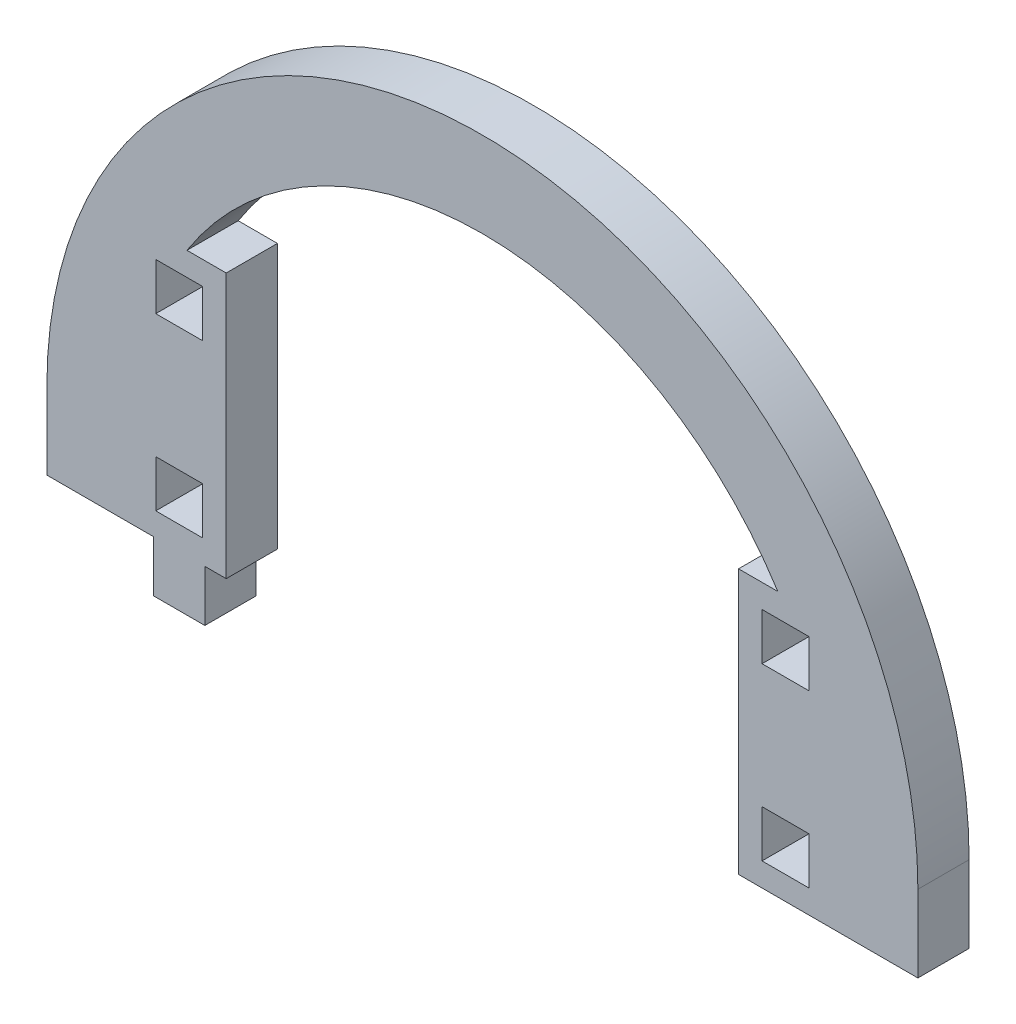
ISO-10303-21;
HEADER;
FILE_DESCRIPTION(('STEP AP214'),'2;1');
FILE_NAME('part.step','',(''),(''),'','','');
FILE_SCHEMA(('AUTOMOTIVE_DESIGN { 1 0 10303 214 1 1 1 1 }'));
ENDSEC;
DATA;
#1=APPLICATION_CONTEXT('core data for automotive mechanical design processes');
#2=APPLICATION_PROTOCOL_DEFINITION('international standard','automotive_design',2000,#1);
#3=PRODUCT_CONTEXT('',#1,'mechanical');
#4=PRODUCT('Part','Part','',(#3));
#5=PRODUCT_RELATED_PRODUCT_CATEGORY('part','',(#4));
#6=PRODUCT_DEFINITION_FORMATION('','',#4);
#7=PRODUCT_DEFINITION_CONTEXT('part definition',#1,'design');
#8=PRODUCT_DEFINITION('design','',#6,#7);
#9=PRODUCT_DEFINITION_SHAPE('','',#8);
#10=(LENGTH_UNIT() NAMED_UNIT(*) SI_UNIT(.MILLI.,.METRE.));
#11=(NAMED_UNIT(*) PLANE_ANGLE_UNIT() SI_UNIT($,.RADIAN.));
#12=(NAMED_UNIT(*) SI_UNIT($,.STERADIAN.) SOLID_ANGLE_UNIT());
#13=UNCERTAINTY_MEASURE_WITH_UNIT(LENGTH_MEASURE(1.E-05),#10,'distance_accuracy_value','');
#14=(GEOMETRIC_REPRESENTATION_CONTEXT(3) GLOBAL_UNCERTAINTY_ASSIGNED_CONTEXT((#13)) GLOBAL_UNIT_ASSIGNED_CONTEXT((#10,
#11,#12)) REPRESENTATION_CONTEXT('',''));
#15=CARTESIAN_POINT('',(0.,0.,0.));
#16=DIRECTION('',(0.,0.,1.));
#17=DIRECTION('',(1.,0.,0.));
#18=AXIS2_PLACEMENT_3D('',#15,#16,#17);
#19=CARTESIAN_POINT('',(3106.22516019874,1478.74469762239,6.));
#20=DIRECTION('',(0.,0.,1.));
#21=DIRECTION('',(1.,0.,0.));
#22=AXIS2_PLACEMENT_3D('',#19,#20,#21);
#23=PLANE('',#22);
#24=CARTESIAN_POINT('',(3106.22516019874,1478.74469762239,6.));
#25=DIRECTION('',(0.,0.,1.));
#26=DIRECTION('',(1.,0.,0.));
#27=AXIS2_PLACEMENT_3D('',#24,#25,#26);
#28=CIRCLE('',#27,50.9999999999999);
#29=CARTESIAN_POINT('',(3157.22516019874,1478.74469762239,6.));
#30=VERTEX_POINT('',#29);
#31=CARTESIAN_POINT('',(3055.22516019874,1478.74469762239,6.));
#32=VERTEX_POINT('',#31);
#33=EDGE_CURVE('E642',#30,#32,#28,.T.);
#34=ORIENTED_EDGE('',*,*,#33,.T.);
#35=DIRECTION('',(0.,-1.,0.));
#36=VECTOR('',#35,1.);
#37=CARTESIAN_POINT('',(3055.22516019874,1478.74469762239,6.));
#38=LINE('',#37,#36);
#39=CARTESIAN_POINT('',(3055.22516019874,1469.74469762239,6.));
#40=VERTEX_POINT('',#39);
#41=EDGE_CURVE('E646',#32,#40,#38,.T.);
#42=ORIENTED_EDGE('',*,*,#41,.T.);
#43=DIRECTION('',(1.,0.,0.));
#44=VECTOR('',#43,1.);
#45=CARTESIAN_POINT('',(3055.22516019874,1469.74469762239,6.));
#46=LINE('',#45,#44);
#47=CARTESIAN_POINT('',(3067.72516019874,1469.74469762239,6.));
#48=VERTEX_POINT('',#47);
#49=EDGE_CURVE('E650',#40,#48,#46,.T.);
#50=ORIENTED_EDGE('',*,*,#49,.T.);
#51=DIRECTION('',(0.,-1.,0.));
#52=VECTOR('',#51,1.);
#53=CARTESIAN_POINT('',(3067.72516019874,1469.74469762239,6.));
#54=LINE('',#53,#52);
#55=CARTESIAN_POINT('',(3067.72516019874,1463.74469762239,6.));
#56=VERTEX_POINT('',#55);
#57=EDGE_CURVE('E653',#48,#56,#54,.T.);
#58=ORIENTED_EDGE('',*,*,#57,.T.);
#59=DIRECTION('',(1.,0.,0.));
#60=VECTOR('',#59,1.);
#61=CARTESIAN_POINT('',(3067.72516019874,1463.74469762239,6.));
#62=LINE('',#61,#60);
#63=CARTESIAN_POINT('',(3073.72516019874,1463.74469762239,6.));
#64=VERTEX_POINT('',#63);
#65=EDGE_CURVE('E656',#56,#64,#62,.T.);
#66=ORIENTED_EDGE('',*,*,#65,.T.);
#67=DIRECTION('',(0.,1.,0.));
#68=VECTOR('',#67,1.);
#69=CARTESIAN_POINT('',(3073.72516019874,1463.74469762239,6.));
#70=LINE('',#69,#68);
#71=CARTESIAN_POINT('',(3073.72516019874,1469.74469762239,6.));
#72=VERTEX_POINT('',#71);
#73=EDGE_CURVE('E659',#64,#72,#70,.T.);
#74=ORIENTED_EDGE('',*,*,#73,.T.);
#75=DIRECTION('',(1.,0.,0.));
#76=VECTOR('',#75,1.);
#77=CARTESIAN_POINT('',(3073.72516019874,1469.74469762239,6.));
#78=LINE('',#77,#76);
#79=CARTESIAN_POINT('',(3076.22516019874,1469.74469762239,6.));
#80=VERTEX_POINT('',#79);
#81=EDGE_CURVE('E662',#72,#80,#78,.T.);
#82=ORIENTED_EDGE('',*,*,#81,.T.);
#83=DIRECTION('',(0.,-1.,0.));
#84=VECTOR('',#83,1.);
#85=CARTESIAN_POINT('',(3076.22516019874,1500.74469762239,6.));
#86=LINE('',#85,#84);
#87=CARTESIAN_POINT('',(3076.22516019874,1500.74469762239,6.));
#88=VERTEX_POINT('',#87);
#89=EDGE_CURVE('E665',#88,#80,#86,.T.);
#90=ORIENTED_EDGE('',*,*,#89,.F.);
#91=DIRECTION('',(-1.,0.,0.));
#92=VECTOR('',#91,1.);
#93=CARTESIAN_POINT('',(3076.22516019874,1500.74469762239,6.));
#94=LINE('',#93,#92);
#95=CARTESIAN_POINT('',(3071.62747241473,1500.74469762239,6.));
#96=VERTEX_POINT('',#95);
#97=EDGE_CURVE('E669',#88,#96,#94,.T.);
#98=ORIENTED_EDGE('',*,*,#97,.T.);
#99=CARTESIAN_POINT('',(3106.22516019874,1478.74469762239,6.));
#100=DIRECTION('',(0.,0.,1.));
#101=DIRECTION('',(1.,0.,0.));
#102=AXIS2_PLACEMENT_3D('',#99,#100,#101);
#103=CIRCLE('',#102,40.9999999999998);
#104=CARTESIAN_POINT('',(3140.82284798276,1500.74469762239,6.));
#105=VERTEX_POINT('',#104);
#106=EDGE_CURVE('E672',#105,#96,#103,.T.);
#107=ORIENTED_EDGE('',*,*,#106,.F.);
#108=DIRECTION('',(-1.,0.,0.));
#109=VECTOR('',#108,1.);
#110=CARTESIAN_POINT('',(3140.82284798276,1500.74469762239,6.));
#111=LINE('',#110,#109);
#112=CARTESIAN_POINT('',(3136.22516019874,1500.74469762239,6.));
#113=VERTEX_POINT('',#112);
#114=EDGE_CURVE('E676',#105,#113,#111,.T.);
#115=ORIENTED_EDGE('',*,*,#114,.T.);
#116=DIRECTION('',(0.,-1.,0.));
#117=VECTOR('',#116,1.);
#118=CARTESIAN_POINT('',(3136.22516019874,1500.74469762239,6.));
#119=LINE('',#118,#117);
#120=CARTESIAN_POINT('',(3136.22516019874,1469.74469762239,6.));
#121=VERTEX_POINT('',#120);
#122=EDGE_CURVE('E679',#113,#121,#119,.T.);
#123=ORIENTED_EDGE('',*,*,#122,.T.);
#124=DIRECTION('',(1.,0.,0.));
#125=VECTOR('',#124,1.);
#126=CARTESIAN_POINT('',(3136.22516019874,1469.74469762239,6.));
#127=LINE('',#126,#125);
#128=CARTESIAN_POINT('',(3157.22516019874,1469.74469762239,6.));
#129=VERTEX_POINT('',#128);
#130=EDGE_CURVE('E682',#121,#129,#127,.T.);
#131=ORIENTED_EDGE('',*,*,#130,.T.);
#132=DIRECTION('',(0.,-1.,0.));
#133=VECTOR('',#132,1.);
#134=CARTESIAN_POINT('',(3157.22516019874,1478.74469762239,6.));
#135=LINE('',#134,#133);
#136=EDGE_CURVE('E685',#30,#129,#135,.T.);
#137=ORIENTED_EDGE('',*,*,#136,.F.);
#138=EDGE_LOOP('',(#34,#42,#50,#58,#66,#74,#82,#90,#98,#107,#115,#123,#131,#137));
#139=FACE_BOUND('',#138,.T.);
#140=DIRECTION('',(0.,1.,0.));
#141=VECTOR('',#140,1.);
#142=CARTESIAN_POINT('',(3073.47516019874,0.,6.));
#143=LINE('',#142,#141);
#144=CARTESIAN_POINT('',(3073.47516019874,1472.49469762239,6.));
#145=VERTEX_POINT('',#144);
#146=CARTESIAN_POINT('',(3073.47516019874,1477.99469762239,6.));
#147=VERTEX_POINT('',#146);
#148=EDGE_CURVE('E602',#145,#147,#143,.T.);
#149=ORIENTED_EDGE('',*,*,#148,.F.);
#150=DIRECTION('',(1.,0.,0.));
#151=VECTOR('',#150,1.);
#152=CARTESIAN_POINT('',(0.,1472.49469762239,6.));
#153=LINE('',#152,#151);
#154=CARTESIAN_POINT('',(3067.97516019874,1472.49469762239,6.));
#155=VERTEX_POINT('',#154);
#156=EDGE_CURVE('E599',#155,#145,#153,.T.);
#157=ORIENTED_EDGE('',*,*,#156,.F.);
#158=DIRECTION('',(0.,-1.,0.));
#159=VECTOR('',#158,1.);
#160=CARTESIAN_POINT('',(3067.97516019874,0.,6.));
#161=LINE('',#160,#159);
#162=CARTESIAN_POINT('',(3067.97516019874,1477.99469762239,6.));
#163=VERTEX_POINT('',#162);
#164=EDGE_CURVE('E610',#163,#155,#161,.T.);
#165=ORIENTED_EDGE('',*,*,#164,.F.);
#166=DIRECTION('',(-1.,0.,0.));
#167=VECTOR('',#166,1.);
#168=CARTESIAN_POINT('',(0.,1477.99469762239,6.));
#169=LINE('',#168,#167);
#170=EDGE_CURVE('E606',#147,#163,#169,.T.);
#171=ORIENTED_EDGE('',*,*,#170,.F.);
#172=EDGE_LOOP('',(#149,#157,#165,#171));
#173=FACE_BOUND('',#172,.T.);
#174=DIRECTION('',(0.,1.,0.));
#175=VECTOR('',#174,1.);
#176=CARTESIAN_POINT('',(3073.47516019874,0.,6.));
#177=LINE('',#176,#175);
#178=CARTESIAN_POINT('',(3073.47516019874,1492.49469762239,6.));
#179=VERTEX_POINT('',#178);
#180=CARTESIAN_POINT('',(3073.47516019874,1497.99469762239,6.));
#181=VERTEX_POINT('',#180);
#182=EDGE_CURVE('E559',#179,#181,#177,.T.);
#183=ORIENTED_EDGE('',*,*,#182,.F.);
#184=DIRECTION('',(1.,0.,0.));
#185=VECTOR('',#184,1.);
#186=CARTESIAN_POINT('',(0.,1492.49469762239,6.));
#187=LINE('',#186,#185);
#188=CARTESIAN_POINT('',(3067.97516019874,1492.49469762239,6.));
#189=VERTEX_POINT('',#188);
#190=EDGE_CURVE('E556',#189,#179,#187,.T.);
#191=ORIENTED_EDGE('',*,*,#190,.F.);
#192=DIRECTION('',(0.,-1.,0.));
#193=VECTOR('',#192,1.);
#194=CARTESIAN_POINT('',(3067.97516019874,0.,6.));
#195=LINE('',#194,#193);
#196=CARTESIAN_POINT('',(3067.97516019874,1497.99469762239,6.));
#197=VERTEX_POINT('',#196);
#198=EDGE_CURVE('E567',#197,#189,#195,.T.);
#199=ORIENTED_EDGE('',*,*,#198,.F.);
#200=DIRECTION('',(-1.,0.,0.));
#201=VECTOR('',#200,1.);
#202=CARTESIAN_POINT('',(0.,1497.99469762239,6.));
#203=LINE('',#202,#201);
#204=EDGE_CURVE('E563',#181,#197,#203,.T.);
#205=ORIENTED_EDGE('',*,*,#204,.F.);
#206=EDGE_LOOP('',(#183,#191,#199,#205));
#207=FACE_BOUND('',#206,.T.);
#208=DIRECTION('',(0.,1.,0.));
#209=VECTOR('',#208,1.);
#210=CARTESIAN_POINT('',(3144.47516019875,0.,6.));
#211=LINE('',#210,#209);
#212=CARTESIAN_POINT('',(3144.47516019875,1492.49469762239,6.));
#213=VERTEX_POINT('',#212);
#214=CARTESIAN_POINT('',(3144.47516019875,1497.99469762239,6.));
#215=VERTEX_POINT('',#214);
#216=EDGE_CURVE('E516',#213,#215,#211,.T.);
#217=ORIENTED_EDGE('',*,*,#216,.F.);
#218=DIRECTION('',(1.,0.,0.));
#219=VECTOR('',#218,1.);
#220=CARTESIAN_POINT('',(0.,1492.49469762239,6.));
#221=LINE('',#220,#219);
#222=CARTESIAN_POINT('',(3138.97516019874,1492.49469762239,6.));
#223=VERTEX_POINT('',#222);
#224=EDGE_CURVE('E513',#223,#213,#221,.T.);
#225=ORIENTED_EDGE('',*,*,#224,.F.);
#226=DIRECTION('',(0.,-1.,0.));
#227=VECTOR('',#226,1.);
#228=CARTESIAN_POINT('',(3138.97516019874,0.,6.));
#229=LINE('',#228,#227);
#230=CARTESIAN_POINT('',(3138.97516019874,1497.99469762239,6.));
#231=VERTEX_POINT('',#230);
#232=EDGE_CURVE('E524',#231,#223,#229,.T.);
#233=ORIENTED_EDGE('',*,*,#232,.F.);
#234=DIRECTION('',(-1.,0.,0.));
#235=VECTOR('',#234,1.);
#236=CARTESIAN_POINT('',(0.,1497.99469762239,6.));
#237=LINE('',#236,#235);
#238=EDGE_CURVE('E520',#215,#231,#237,.T.);
#239=ORIENTED_EDGE('',*,*,#238,.F.);
#240=EDGE_LOOP('',(#217,#225,#233,#239));
#241=FACE_BOUND('',#240,.T.);
#242=DIRECTION('',(0.,1.,0.));
#243=VECTOR('',#242,1.);
#244=CARTESIAN_POINT('',(3144.47516019875,0.,6.));
#245=LINE('',#244,#243);
#246=CARTESIAN_POINT('',(3144.47516019875,1472.49469762239,6.));
#247=VERTEX_POINT('',#246);
#248=CARTESIAN_POINT('',(3144.47516019875,1477.99469762239,6.));
#249=VERTEX_POINT('',#248);
#250=EDGE_CURVE('E474',#247,#249,#245,.T.);
#251=ORIENTED_EDGE('',*,*,#250,.F.);
#252=DIRECTION('',(1.,0.,0.));
#253=VECTOR('',#252,1.);
#254=CARTESIAN_POINT('',(0.,1472.49469762239,6.));
#255=LINE('',#254,#253);
#256=CARTESIAN_POINT('',(3138.97516019874,1472.49469762239,6.));
#257=VERTEX_POINT('',#256);
#258=EDGE_CURVE('E465',#257,#247,#255,.T.);
#259=ORIENTED_EDGE('',*,*,#258,.F.);
#260=DIRECTION('',(0.,-1.,0.));
#261=VECTOR('',#260,1.);
#262=CARTESIAN_POINT('',(3138.97516019874,0.,6.));
#263=LINE('',#262,#261);
#264=CARTESIAN_POINT('',(3138.97516019874,1477.99469762239,6.));
#265=VERTEX_POINT('',#264);
#266=EDGE_CURVE('E491',#265,#257,#263,.T.);
#267=ORIENTED_EDGE('',*,*,#266,.F.);
#268=DIRECTION('',(-1.,0.,0.));
#269=VECTOR('',#268,1.);
#270=CARTESIAN_POINT('',(0.,1477.99469762239,6.));
#271=LINE('',#270,#269);
#272=EDGE_CURVE('E487',#249,#265,#271,.T.);
#273=ORIENTED_EDGE('',*,*,#272,.F.);
#274=EDGE_LOOP('',(#251,#259,#267,#273));
#275=FACE_BOUND('',#274,.T.);
#276=ADVANCED_FACE('F267',(#139,#173,#207,#241,#275),#23,.T.);
#277=CARTESIAN_POINT('',(3106.22516019874,1478.74469762239,0.));
#278=DIRECTION('',(0.,0.,1.));
#279=DIRECTION('',(1.,0.,0.));
#280=AXIS2_PLACEMENT_3D('',#277,#278,#279);
#281=PLANE('',#280);
#282=DIRECTION('',(1.,0.,0.));
#283=VECTOR('',#282,1.);
#284=CARTESIAN_POINT('',(0.,1492.49469762239,0.));
#285=LINE('',#284,#283);
#286=CARTESIAN_POINT('',(3138.97516019874,1492.49469762239,0.));
#287=VERTEX_POINT('',#286);
#288=CARTESIAN_POINT('',(3144.47516019875,1492.49469762239,0.));
#289=VERTEX_POINT('',#288);
#290=EDGE_CURVE('E483',#287,#289,#285,.T.);
#291=ORIENTED_EDGE('',*,*,#290,.T.);
#292=DIRECTION('',(0.,1.,0.));
#293=VECTOR('',#292,1.);
#294=CARTESIAN_POINT('',(3144.47516019875,0.,0.));
#295=LINE('',#294,#293);
#296=CARTESIAN_POINT('',(3144.47516019875,1497.99469762239,0.));
#297=VERTEX_POINT('',#296);
#298=EDGE_CURVE('E531',#289,#297,#295,.T.);
#299=ORIENTED_EDGE('',*,*,#298,.T.);
#300=DIRECTION('',(-1.,0.,0.));
#301=VECTOR('',#300,1.);
#302=CARTESIAN_POINT('',(0.,1497.99469762239,0.));
#303=LINE('',#302,#301);
#304=CARTESIAN_POINT('',(3138.97516019874,1497.99469762239,0.));
#305=VERTEX_POINT('',#304);
#306=EDGE_CURVE('E535',#297,#305,#303,.T.);
#307=ORIENTED_EDGE('',*,*,#306,.T.);
#308=DIRECTION('',(0.,-1.,0.));
#309=VECTOR('',#308,1.);
#310=CARTESIAN_POINT('',(3138.97516019874,0.,0.));
#311=LINE('',#310,#309);
#312=EDGE_CURVE('E517',#305,#287,#311,.T.);
#313=ORIENTED_EDGE('',*,*,#312,.T.);
#314=EDGE_LOOP('',(#291,#299,#307,#313));
#315=FACE_BOUND('',#314,.T.);
#316=DIRECTION('',(1.,0.,0.));
#317=VECTOR('',#316,1.);
#318=CARTESIAN_POINT('',(0.,1472.49469762239,0.));
#319=LINE('',#318,#317);
#320=CARTESIAN_POINT('',(3067.97516019874,1472.49469762239,0.));
#321=VERTEX_POINT('',#320);
#322=CARTESIAN_POINT('',(3073.47516019874,1472.49469762239,0.));
#323=VERTEX_POINT('',#322);
#324=EDGE_CURVE('E598',#321,#323,#319,.T.);
#325=ORIENTED_EDGE('',*,*,#324,.T.);
#326=DIRECTION('',(0.,1.,0.));
#327=VECTOR('',#326,1.);
#328=CARTESIAN_POINT('',(3073.47516019874,0.,0.));
#329=LINE('',#328,#327);
#330=CARTESIAN_POINT('',(3073.47516019874,1477.99469762239,0.));
#331=VERTEX_POINT('',#330);
#332=EDGE_CURVE('E617',#323,#331,#329,.T.);
#333=ORIENTED_EDGE('',*,*,#332,.T.);
#334=DIRECTION('',(-1.,0.,0.));
#335=VECTOR('',#334,1.);
#336=CARTESIAN_POINT('',(0.,1477.99469762239,0.));
#337=LINE('',#336,#335);
#338=CARTESIAN_POINT('',(3067.97516019874,1477.99469762239,0.));
#339=VERTEX_POINT('',#338);
#340=EDGE_CURVE('E621',#331,#339,#337,.T.);
#341=ORIENTED_EDGE('',*,*,#340,.T.);
#342=DIRECTION('',(0.,-1.,0.));
#343=VECTOR('',#342,1.);
#344=CARTESIAN_POINT('',(3067.97516019874,0.,0.));
#345=LINE('',#344,#343);
#346=EDGE_CURVE('E603',#339,#321,#345,.T.);
#347=ORIENTED_EDGE('',*,*,#346,.T.);
#348=EDGE_LOOP('',(#325,#333,#341,#347));
#349=FACE_BOUND('',#348,.T.);
#350=CARTESIAN_POINT('',(3106.22516019874,1478.74469762239,0.));
#351=DIRECTION('',(0.,0.,1.));
#352=DIRECTION('',(1.,0.,0.));
#353=AXIS2_PLACEMENT_3D('',#350,#351,#352);
#354=CIRCLE('',#353,50.9999999999999);
#355=CARTESIAN_POINT('',(3157.22516019874,1478.74469762239,0.));
#356=VERTEX_POINT('',#355);
#357=CARTESIAN_POINT('',(3055.22516019874,1478.74469762239,0.));
#358=VERTEX_POINT('',#357);
#359=EDGE_CURVE('E641',#356,#358,#354,.T.);
#360=ORIENTED_EDGE('',*,*,#359,.F.);
#361=DIRECTION('',(0.,-1.,0.));
#362=VECTOR('',#361,1.);
#363=CARTESIAN_POINT('',(3157.22516019874,1478.74469762239,0.));
#364=LINE('',#363,#362);
#365=CARTESIAN_POINT('',(3157.22516019874,1469.74469762239,0.));
#366=VERTEX_POINT('',#365);
#367=EDGE_CURVE('E647',#356,#366,#364,.T.);
#368=ORIENTED_EDGE('',*,*,#367,.T.);
#369=DIRECTION('',(-1.,0.,0.));
#370=VECTOR('',#369,1.);
#371=CARTESIAN_POINT('',(3157.22516019874,1469.74469762239,0.));
#372=LINE('',#371,#370);
#373=CARTESIAN_POINT('',(3136.22516019874,1469.74469762239,0.));
#374=VERTEX_POINT('',#373);
#375=EDGE_CURVE('E731',#366,#374,#372,.T.);
#376=ORIENTED_EDGE('',*,*,#375,.T.);
#377=DIRECTION('',(0.,-1.,0.));
#378=VECTOR('',#377,1.);
#379=CARTESIAN_POINT('',(3136.22516019874,1500.74469762239,0.));
#380=LINE('',#379,#378);
#381=CARTESIAN_POINT('',(3136.22516019874,1500.74469762239,0.));
#382=VERTEX_POINT('',#381);
#383=EDGE_CURVE('E727',#382,#374,#380,.T.);
#384=ORIENTED_EDGE('',*,*,#383,.F.);
#385=DIRECTION('',(-1.,0.,0.));
#386=VECTOR('',#385,1.);
#387=CARTESIAN_POINT('',(3140.82284798276,1500.74469762239,0.));
#388=LINE('',#387,#386);
#389=CARTESIAN_POINT('',(3140.82284798276,1500.74469762239,0.));
#390=VERTEX_POINT('',#389);
#391=EDGE_CURVE('E724',#390,#382,#388,.T.);
#392=ORIENTED_EDGE('',*,*,#391,.F.);
#393=CARTESIAN_POINT('',(3106.22516019874,1478.74469762239,0.));
#394=DIRECTION('',(0.,0.,1.));
#395=DIRECTION('',(1.,0.,0.));
#396=AXIS2_PLACEMENT_3D('',#393,#394,#395);
#397=CIRCLE('',#396,40.9999999999998);
#398=CARTESIAN_POINT('',(3071.62747241473,1500.74469762239,0.));
#399=VERTEX_POINT('',#398);
#400=EDGE_CURVE('E720',#390,#399,#397,.T.);
#401=ORIENTED_EDGE('',*,*,#400,.T.);
#402=DIRECTION('',(-1.,0.,0.));
#403=VECTOR('',#402,1.);
#404=CARTESIAN_POINT('',(3076.22516019874,1500.74469762239,0.));
#405=LINE('',#404,#403);
#406=CARTESIAN_POINT('',(3076.22516019874,1500.74469762239,0.));
#407=VERTEX_POINT('',#406);
#408=EDGE_CURVE('E716',#407,#399,#405,.T.);
#409=ORIENTED_EDGE('',*,*,#408,.F.);
#410=DIRECTION('',(0.,-1.,0.));
#411=VECTOR('',#410,1.);
#412=CARTESIAN_POINT('',(3076.22516019874,1500.74469762239,0.));
#413=LINE('',#412,#411);
#414=CARTESIAN_POINT('',(3076.22516019874,1469.74469762239,0.));
#415=VERTEX_POINT('',#414);
#416=EDGE_CURVE('E712',#407,#415,#413,.T.);
#417=ORIENTED_EDGE('',*,*,#416,.T.);
#418=DIRECTION('',(1.,0.,0.));
#419=VECTOR('',#418,1.);
#420=CARTESIAN_POINT('',(3073.72516019874,1469.74469762239,0.));
#421=LINE('',#420,#419);
#422=CARTESIAN_POINT('',(3073.72516019874,1469.74469762239,0.));
#423=VERTEX_POINT('',#422);
#424=EDGE_CURVE('E708',#423,#415,#421,.T.);
#425=ORIENTED_EDGE('',*,*,#424,.F.);
#426=DIRECTION('',(0.,1.,0.));
#427=VECTOR('',#426,1.);
#428=CARTESIAN_POINT('',(3073.72516019874,1463.74469762239,0.));
#429=LINE('',#428,#427);
#430=CARTESIAN_POINT('',(3073.72516019874,1463.74469762239,0.));
#431=VERTEX_POINT('',#430);
#432=EDGE_CURVE('E705',#431,#423,#429,.T.);
#433=ORIENTED_EDGE('',*,*,#432,.F.);
#434=DIRECTION('',(1.,0.,0.));
#435=VECTOR('',#434,1.);
#436=CARTESIAN_POINT('',(3067.72516019874,1463.74469762239,0.));
#437=LINE('',#436,#435);
#438=CARTESIAN_POINT('',(3067.72516019874,1463.74469762239,0.));
#439=VERTEX_POINT('',#438);
#440=EDGE_CURVE('E702',#439,#431,#437,.T.);
#441=ORIENTED_EDGE('',*,*,#440,.F.);
#442=DIRECTION('',(0.,-1.,0.));
#443=VECTOR('',#442,1.);
#444=CARTESIAN_POINT('',(3067.72516019874,1469.74469762239,0.));
#445=LINE('',#444,#443);
#446=CARTESIAN_POINT('',(3067.72516019874,1469.74469762239,0.));
#447=VERTEX_POINT('',#446);
#448=EDGE_CURVE('E699',#447,#439,#445,.T.);
#449=ORIENTED_EDGE('',*,*,#448,.F.);
#450=DIRECTION('',(1.,0.,0.));
#451=VECTOR('',#450,1.);
#452=CARTESIAN_POINT('',(3055.22516019874,1469.74469762239,0.));
#453=LINE('',#452,#451);
#454=CARTESIAN_POINT('',(3055.22516019874,1469.74469762239,0.));
#455=VERTEX_POINT('',#454);
#456=EDGE_CURVE('E696',#455,#447,#453,.T.);
#457=ORIENTED_EDGE('',*,*,#456,.F.);
#458=DIRECTION('',(0.,-1.,0.));
#459=VECTOR('',#458,1.);
#460=CARTESIAN_POINT('',(3055.22516019874,1478.74469762239,0.));
#461=LINE('',#460,#459);
#462=EDGE_CURVE('E693',#358,#455,#461,.T.);
#463=ORIENTED_EDGE('',*,*,#462,.F.);
#464=EDGE_LOOP('',(#360,#368,#376,#384,#392,#401,#409,#417,#425,#433,#441,#449,#457,#463));
#465=FACE_BOUND('',#464,.T.);
#466=DIRECTION('',(1.,0.,0.));
#467=VECTOR('',#466,1.);
#468=CARTESIAN_POINT('',(0.,1492.49469762239,0.));
#469=LINE('',#468,#467);
#470=CARTESIAN_POINT('',(3067.97516019874,1492.49469762239,0.));
#471=VERTEX_POINT('',#470);
#472=CARTESIAN_POINT('',(3073.47516019874,1492.49469762239,0.));
#473=VERTEX_POINT('',#472);
#474=EDGE_CURVE('E555',#471,#473,#469,.T.);
#475=ORIENTED_EDGE('',*,*,#474,.T.);
#476=DIRECTION('',(0.,1.,0.));
#477=VECTOR('',#476,1.);
#478=CARTESIAN_POINT('',(3073.47516019874,0.,0.));
#479=LINE('',#478,#477);
#480=CARTESIAN_POINT('',(3073.47516019874,1497.99469762239,0.));
#481=VERTEX_POINT('',#480);
#482=EDGE_CURVE('E574',#473,#481,#479,.T.);
#483=ORIENTED_EDGE('',*,*,#482,.T.);
#484=DIRECTION('',(-1.,0.,0.));
#485=VECTOR('',#484,1.);
#486=CARTESIAN_POINT('',(0.,1497.99469762239,0.));
#487=LINE('',#486,#485);
#488=CARTESIAN_POINT('',(3067.97516019874,1497.99469762239,0.));
#489=VERTEX_POINT('',#488);
#490=EDGE_CURVE('E578',#481,#489,#487,.T.);
#491=ORIENTED_EDGE('',*,*,#490,.T.);
#492=DIRECTION('',(0.,-1.,0.));
#493=VECTOR('',#492,1.);
#494=CARTESIAN_POINT('',(3067.97516019874,0.,0.));
#495=LINE('',#494,#493);
#496=EDGE_CURVE('E560',#489,#471,#495,.T.);
#497=ORIENTED_EDGE('',*,*,#496,.T.);
#498=EDGE_LOOP('',(#475,#483,#491,#497));
#499=FACE_BOUND('',#498,.T.);
#500=DIRECTION('',(1.,0.,0.));
#501=VECTOR('',#500,1.);
#502=CARTESIAN_POINT('',(0.,1472.49469762239,0.));
#503=LINE('',#502,#501);
#504=CARTESIAN_POINT('',(3138.97516019874,1472.49469762239,0.));
#505=VERTEX_POINT('',#504);
#506=CARTESIAN_POINT('',(3144.47516019875,1472.49469762239,0.));
#507=VERTEX_POINT('',#506);
#508=EDGE_CURVE('E291',#505,#507,#503,.T.);
#509=ORIENTED_EDGE('',*,*,#508,.T.);
#510=DIRECTION('',(0.,1.,0.));
#511=VECTOR('',#510,1.);
#512=CARTESIAN_POINT('',(3144.47516019875,0.,0.));
#513=LINE('',#512,#511);
#514=CARTESIAN_POINT('',(3144.47516019875,1477.99469762239,0.));
#515=VERTEX_POINT('',#514);
#516=EDGE_CURVE('E481',#507,#515,#513,.T.);
#517=ORIENTED_EDGE('',*,*,#516,.T.);
#518=DIRECTION('',(-1.,0.,0.));
#519=VECTOR('',#518,1.);
#520=CARTESIAN_POINT('',(0.,1477.99469762239,0.));
#521=LINE('',#520,#519);
#522=CARTESIAN_POINT('',(3138.97516019874,1477.99469762239,0.));
#523=VERTEX_POINT('',#522);
#524=EDGE_CURVE('E500',#515,#523,#521,.T.);
#525=ORIENTED_EDGE('',*,*,#524,.T.);
#526=DIRECTION('',(0.,-1.,0.));
#527=VECTOR('',#526,1.);
#528=CARTESIAN_POINT('',(3138.97516019874,0.,0.));
#529=LINE('',#528,#527);
#530=EDGE_CURVE('E475',#523,#505,#529,.T.);
#531=ORIENTED_EDGE('',*,*,#530,.T.);
#532=EDGE_LOOP('',(#509,#517,#525,#531));
#533=FACE_BOUND('',#532,.T.);
#534=ADVANCED_FACE('F789',(#315,#349,#465,#499,#533),#281,.F.);
#535=CARTESIAN_POINT('',(3106.22516019874,1478.74469762239,6.));
#536=DIRECTION('',(0.,0.,-1.));
#537=DIRECTION('',(-1.,0.,0.));
#538=AXIS2_PLACEMENT_3D('',#535,#536,#537);
#539=CYLINDRICAL_SURFACE('',#538,50.9999999999999);
#540=ORIENTED_EDGE('',*,*,#359,.T.);
#541=DIRECTION('',(0.,0.,-1.));
#542=VECTOR('',#541,1.);
#543=CARTESIAN_POINT('',(3055.22516019874,1478.74469762239,6.));
#544=LINE('',#543,#542);
#545=EDGE_CURVE('E12',#32,#358,#544,.T.);
#546=ORIENTED_EDGE('',*,*,#545,.F.);
#547=ORIENTED_EDGE('',*,*,#33,.F.);
#548=DIRECTION('',(0.,0.,-1.));
#549=VECTOR('',#548,1.);
#550=CARTESIAN_POINT('',(3157.22516019874,1478.74469762239,6.));
#551=LINE('',#550,#549);
#552=EDGE_CURVE('E689',#30,#356,#551,.T.);
#553=ORIENTED_EDGE('',*,*,#552,.T.);
#554=EDGE_LOOP('',(#540,#546,#547,#553));
#555=FACE_BOUND('',#554,.T.);
#556=ADVANCED_FACE('F269',(#555),#539,.T.);
#557=CARTESIAN_POINT('',(3055.22516019874,1478.74469762239,6.));
#558=DIRECTION('',(1.,0.,0.));
#559=DIRECTION('',(0.,0.,-1.));
#560=AXIS2_PLACEMENT_3D('',#557,#558,#559);
#561=PLANE('',#560);
#562=ORIENTED_EDGE('',*,*,#462,.T.);
#563=DIRECTION('',(0.,0.,-1.));
#564=VECTOR('',#563,1.);
#565=CARTESIAN_POINT('',(3055.22516019874,1469.74469762239,6.));
#566=LINE('',#565,#564);
#567=EDGE_CURVE('E276',#40,#455,#566,.T.);
#568=ORIENTED_EDGE('',*,*,#567,.F.);
#569=ORIENTED_EDGE('',*,*,#41,.F.);
#570=ORIENTED_EDGE('',*,*,#545,.T.);
#571=EDGE_LOOP('',(#562,#568,#569,#570));
#572=FACE_BOUND('',#571,.T.);
#573=ADVANCED_FACE('F808',(#572),#561,.F.);
#574=CARTESIAN_POINT('',(3055.22516019874,1469.74469762239,6.));
#575=DIRECTION('',(0.,1.,0.));
#576=DIRECTION('',(0.,0.,1.));
#577=AXIS2_PLACEMENT_3D('',#574,#575,#576);
#578=PLANE('',#577);
#579=ORIENTED_EDGE('',*,*,#456,.T.);
#580=DIRECTION('',(0.,0.,-1.));
#581=VECTOR('',#580,1.);
#582=CARTESIAN_POINT('',(3067.72516019874,1469.74469762239,6.));
#583=LINE('',#582,#581);
#584=EDGE_CURVE('E774',#48,#447,#583,.T.);
#585=ORIENTED_EDGE('',*,*,#584,.F.);
#586=ORIENTED_EDGE('',*,*,#49,.F.);
#587=ORIENTED_EDGE('',*,*,#567,.T.);
#588=EDGE_LOOP('',(#579,#585,#586,#587));
#589=FACE_BOUND('',#588,.T.);
#590=ADVANCED_FACE('F783',(#589),#578,.F.);
#591=CARTESIAN_POINT('',(3067.72516019874,1469.74469762239,6.));
#592=DIRECTION('',(1.,0.,0.));
#593=DIRECTION('',(0.,0.,-1.));
#594=AXIS2_PLACEMENT_3D('',#591,#592,#593);
#595=PLANE('',#594);
#596=ORIENTED_EDGE('',*,*,#448,.T.);
#597=DIRECTION('',(0.,0.,-1.));
#598=VECTOR('',#597,1.);
#599=CARTESIAN_POINT('',(3067.72516019874,1463.74469762239,6.));
#600=LINE('',#599,#598);
#601=EDGE_CURVE('E770',#56,#439,#600,.T.);
#602=ORIENTED_EDGE('',*,*,#601,.F.);
#603=ORIENTED_EDGE('',*,*,#57,.F.);
#604=ORIENTED_EDGE('',*,*,#584,.T.);
#605=EDGE_LOOP('',(#596,#602,#603,#604));
#606=FACE_BOUND('',#605,.T.);
#607=ADVANCED_FACE('F795',(#606),#595,.F.);
#608=CARTESIAN_POINT('',(3067.72516019874,1463.74469762239,6.));
#609=DIRECTION('',(0.,1.,0.));
#610=DIRECTION('',(0.,0.,1.));
#611=AXIS2_PLACEMENT_3D('',#608,#609,#610);
#612=PLANE('',#611);
#613=ORIENTED_EDGE('',*,*,#440,.T.);
#614=DIRECTION('',(0.,0.,-1.));
#615=VECTOR('',#614,1.);
#616=CARTESIAN_POINT('',(3073.72516019874,1463.74469762239,6.));
#617=LINE('',#616,#615);
#618=EDGE_CURVE('E766',#64,#431,#617,.T.);
#619=ORIENTED_EDGE('',*,*,#618,.F.);
#620=ORIENTED_EDGE('',*,*,#65,.F.);
#621=ORIENTED_EDGE('',*,*,#601,.T.);
#622=EDGE_LOOP('',(#613,#619,#620,#621));
#623=FACE_BOUND('',#622,.T.);
#624=ADVANCED_FACE('F799',(#623),#612,.F.);
#625=CARTESIAN_POINT('',(3073.72516019874,1463.74469762239,6.));
#626=DIRECTION('',(-1.,0.,0.));
#627=DIRECTION('',(0.,0.,1.));
#628=AXIS2_PLACEMENT_3D('',#625,#626,#627);
#629=PLANE('',#628);
#630=ORIENTED_EDGE('',*,*,#432,.T.);
#631=DIRECTION('',(0.,0.,-1.));
#632=VECTOR('',#631,1.);
#633=CARTESIAN_POINT('',(3073.72516019874,1469.74469762239,6.));
#634=LINE('',#633,#632);
#635=EDGE_CURVE('E762',#72,#423,#634,.T.);
#636=ORIENTED_EDGE('',*,*,#635,.F.);
#637=ORIENTED_EDGE('',*,*,#73,.F.);
#638=ORIENTED_EDGE('',*,*,#618,.T.);
#639=EDGE_LOOP('',(#630,#636,#637,#638));
#640=FACE_BOUND('',#639,.T.);
#641=ADVANCED_FACE('F847',(#640),#629,.F.);
#642=CARTESIAN_POINT('',(3073.72516019874,1469.74469762239,6.));
#643=DIRECTION('',(0.,1.,0.));
#644=DIRECTION('',(0.,0.,1.));
#645=AXIS2_PLACEMENT_3D('',#642,#643,#644);
#646=PLANE('',#645);
#647=ORIENTED_EDGE('',*,*,#424,.T.);
#648=DIRECTION('',(0.,0.,-1.));
#649=VECTOR('',#648,1.);
#650=CARTESIAN_POINT('',(3076.22516019874,1469.74469762239,6.));
#651=LINE('',#650,#649);
#652=EDGE_CURVE('E759',#80,#415,#651,.T.);
#653=ORIENTED_EDGE('',*,*,#652,.F.);
#654=ORIENTED_EDGE('',*,*,#81,.F.);
#655=ORIENTED_EDGE('',*,*,#635,.T.);
#656=EDGE_LOOP('',(#647,#653,#654,#655));
#657=FACE_BOUND('',#656,.T.);
#658=ADVANCED_FACE('F845',(#657),#646,.F.);
#659=CARTESIAN_POINT('',(3076.22516019874,1500.74469762239,6.));
#660=DIRECTION('',(1.,0.,0.));
#661=DIRECTION('',(0.,0.,-1.));
#662=AXIS2_PLACEMENT_3D('',#659,#660,#661);
#663=PLANE('',#662);
#664=ORIENTED_EDGE('',*,*,#416,.F.);
#665=DIRECTION('',(0.,0.,-1.));
#666=VECTOR('',#665,1.);
#667=CARTESIAN_POINT('',(3076.22516019874,1500.74469762239,6.));
#668=LINE('',#667,#666);
#669=EDGE_CURVE('E756',#88,#407,#668,.T.);
#670=ORIENTED_EDGE('',*,*,#669,.F.);
#671=ORIENTED_EDGE('',*,*,#89,.T.);
#672=ORIENTED_EDGE('',*,*,#652,.T.);
#673=EDGE_LOOP('',(#664,#670,#671,#672));
#674=FACE_BOUND('',#673,.T.);
#675=ADVANCED_FACE('F840',(#674),#663,.T.);
#676=CARTESIAN_POINT('',(3076.22516019874,1500.74469762239,6.));
#677=DIRECTION('',(0.,-1.,0.));
#678=DIRECTION('',(0.,0.,-1.));
#679=AXIS2_PLACEMENT_3D('',#676,#677,#678);
#680=PLANE('',#679);
#681=ORIENTED_EDGE('',*,*,#408,.T.);
#682=DIRECTION('',(0.,0.,-1.));
#683=VECTOR('',#682,1.);
#684=CARTESIAN_POINT('',(3071.62747241473,1500.74469762239,6.));
#685=LINE('',#684,#683);
#686=EDGE_CURVE('E753',#96,#399,#685,.T.);
#687=ORIENTED_EDGE('',*,*,#686,.F.);
#688=ORIENTED_EDGE('',*,*,#97,.F.);
#689=ORIENTED_EDGE('',*,*,#669,.T.);
#690=EDGE_LOOP('',(#681,#687,#688,#689));
#691=FACE_BOUND('',#690,.T.);
#692=ADVANCED_FACE('F836',(#691),#680,.F.);
#693=CARTESIAN_POINT('',(3106.22516019874,1478.74469762239,6.));
#694=DIRECTION('',(0.,0.,-1.));
#695=DIRECTION('',(-1.,0.,0.));
#696=AXIS2_PLACEMENT_3D('',#693,#694,#695);
#697=CYLINDRICAL_SURFACE('',#696,40.9999999999998);
#698=ORIENTED_EDGE('',*,*,#400,.F.);
#699=DIRECTION('',(0.,0.,-1.));
#700=VECTOR('',#699,1.);
#701=CARTESIAN_POINT('',(3140.82284798276,1500.74469762239,6.));
#702=LINE('',#701,#700);
#703=EDGE_CURVE('E750',#105,#390,#702,.T.);
#704=ORIENTED_EDGE('',*,*,#703,.F.);
#705=ORIENTED_EDGE('',*,*,#106,.T.);
#706=ORIENTED_EDGE('',*,*,#686,.T.);
#707=EDGE_LOOP('',(#698,#704,#705,#706));
#708=FACE_BOUND('',#707,.T.);
#709=ADVANCED_FACE('F832',(#708),#697,.F.);
#710=CARTESIAN_POINT('',(3140.82284798276,1500.74469762239,6.));
#711=DIRECTION('',(0.,-1.,0.));
#712=DIRECTION('',(0.,0.,-1.));
#713=AXIS2_PLACEMENT_3D('',#710,#711,#712);
#714=PLANE('',#713);
#715=ORIENTED_EDGE('',*,*,#391,.T.);
#716=DIRECTION('',(0.,0.,-1.));
#717=VECTOR('',#716,1.);
#718=CARTESIAN_POINT('',(3136.22516019874,1500.74469762239,6.));
#719=LINE('',#718,#717);
#720=EDGE_CURVE('E746',#113,#382,#719,.T.);
#721=ORIENTED_EDGE('',*,*,#720,.F.);
#722=ORIENTED_EDGE('',*,*,#114,.F.);
#723=ORIENTED_EDGE('',*,*,#703,.T.);
#724=EDGE_LOOP('',(#715,#721,#722,#723));
#725=FACE_BOUND('',#724,.T.);
#726=ADVANCED_FACE('F827',(#725),#714,.F.);
#727=CARTESIAN_POINT('',(3136.22516019874,1500.74469762239,6.));
#728=DIRECTION('',(1.,0.,0.));
#729=DIRECTION('',(0.,0.,-1.));
#730=AXIS2_PLACEMENT_3D('',#727,#728,#729);
#731=PLANE('',#730);
#732=ORIENTED_EDGE('',*,*,#383,.T.);
#733=DIRECTION('',(0.,0.,-1.));
#734=VECTOR('',#733,1.);
#735=CARTESIAN_POINT('',(3136.22516019874,1469.74469762239,6.));
#736=LINE('',#735,#734);
#737=EDGE_CURVE('E742',#121,#374,#736,.T.);
#738=ORIENTED_EDGE('',*,*,#737,.F.);
#739=ORIENTED_EDGE('',*,*,#122,.F.);
#740=ORIENTED_EDGE('',*,*,#720,.T.);
#741=EDGE_LOOP('',(#732,#738,#739,#740));
#742=FACE_BOUND('',#741,.T.);
#743=ADVANCED_FACE('F822',(#742),#731,.F.);
#744=CARTESIAN_POINT('',(3157.22516019874,1469.74469762239,6.));
#745=DIRECTION('',(0.,-1.,0.));
#746=DIRECTION('',(0.,0.,-1.));
#747=AXIS2_PLACEMENT_3D('',#744,#745,#746);
#748=PLANE('',#747);
#749=ORIENTED_EDGE('',*,*,#375,.F.);
#750=DIRECTION('',(0.,0.,-1.));
#751=VECTOR('',#750,1.);
#752=CARTESIAN_POINT('',(3157.22516019874,1469.74469762239,6.));
#753=LINE('',#752,#751);
#754=EDGE_CURVE('E739',#129,#366,#753,.T.);
#755=ORIENTED_EDGE('',*,*,#754,.F.);
#756=ORIENTED_EDGE('',*,*,#130,.F.);
#757=ORIENTED_EDGE('',*,*,#737,.T.);
#758=EDGE_LOOP('',(#749,#755,#756,#757));
#759=FACE_BOUND('',#758,.T.);
#760=ADVANCED_FACE('F817',(#759),#748,.T.);
#761=CARTESIAN_POINT('',(3157.22516019874,1478.74469762239,6.));
#762=DIRECTION('',(1.,0.,0.));
#763=DIRECTION('',(0.,0.,-1.));
#764=AXIS2_PLACEMENT_3D('',#761,#762,#763);
#765=PLANE('',#764);
#766=ORIENTED_EDGE('',*,*,#367,.F.);
#767=ORIENTED_EDGE('',*,*,#552,.F.);
#768=ORIENTED_EDGE('',*,*,#136,.T.);
#769=ORIENTED_EDGE('',*,*,#754,.T.);
#770=EDGE_LOOP('',(#766,#767,#768,#769));
#771=FACE_BOUND('',#770,.T.);
#772=ADVANCED_FACE('F812',(#771),#765,.T.);
#773=CARTESIAN_POINT('',(0.,1472.49469762239,6.));
#774=DIRECTION('',(0.,1.,0.));
#775=DIRECTION('',(0.,0.,1.));
#776=AXIS2_PLACEMENT_3D('',#773,#774,#775);
#777=PLANE('',#776);
#778=ORIENTED_EDGE('',*,*,#324,.F.);
#779=DIRECTION('',(0.,0.,-1.));
#780=VECTOR('',#779,1.);
#781=CARTESIAN_POINT('',(3067.97516019874,1472.49469762239,6.));
#782=LINE('',#781,#780);
#783=EDGE_CURVE('E613',#155,#321,#782,.T.);
#784=ORIENTED_EDGE('',*,*,#783,.F.);
#785=ORIENTED_EDGE('',*,*,#156,.T.);
#786=DIRECTION('',(0.,0.,-1.));
#787=VECTOR('',#786,1.);
#788=CARTESIAN_POINT('',(3073.47516019874,1472.49469762239,6.));
#789=LINE('',#788,#787);
#790=EDGE_CURVE('E637',#145,#323,#789,.T.);
#791=ORIENTED_EDGE('',*,*,#790,.T.);
#792=EDGE_LOOP('',(#778,#784,#785,#791));
#793=FACE_BOUND('',#792,.T.);
#794=ADVANCED_FACE('F864',(#793),#777,.T.);
#795=CARTESIAN_POINT('',(3073.47516019874,0.,6.));
#796=DIRECTION('',(-1.,0.,0.));
#797=DIRECTION('',(0.,0.,1.));
#798=AXIS2_PLACEMENT_3D('',#795,#796,#797);
#799=PLANE('',#798);
#800=ORIENTED_EDGE('',*,*,#332,.F.);
#801=ORIENTED_EDGE('',*,*,#790,.F.);
#802=ORIENTED_EDGE('',*,*,#148,.T.);
#803=DIRECTION('',(0.,0.,-1.));
#804=VECTOR('',#803,1.);
#805=CARTESIAN_POINT('',(3073.47516019874,1477.99469762239,6.));
#806=LINE('',#805,#804);
#807=EDGE_CURVE('E634',#147,#331,#806,.T.);
#808=ORIENTED_EDGE('',*,*,#807,.T.);
#809=EDGE_LOOP('',(#800,#801,#802,#808));
#810=FACE_BOUND('',#809,.T.);
#811=ADVANCED_FACE('F914',(#810),#799,.T.);
#812=CARTESIAN_POINT('',(0.,1477.99469762239,6.));
#813=DIRECTION('',(0.,-1.,0.));
#814=DIRECTION('',(0.,0.,-1.));
#815=AXIS2_PLACEMENT_3D('',#812,#813,#814);
#816=PLANE('',#815);
#817=ORIENTED_EDGE('',*,*,#340,.F.);
#818=ORIENTED_EDGE('',*,*,#807,.F.);
#819=ORIENTED_EDGE('',*,*,#170,.T.);
#820=DIRECTION('',(0.,0.,-1.));
#821=VECTOR('',#820,1.);
#822=CARTESIAN_POINT('',(3067.97516019874,1477.99469762239,6.));
#823=LINE('',#822,#821);
#824=EDGE_CURVE('E631',#163,#339,#823,.T.);
#825=ORIENTED_EDGE('',*,*,#824,.T.);
#826=EDGE_LOOP('',(#817,#818,#819,#825));
#827=FACE_BOUND('',#826,.T.);
#828=ADVANCED_FACE('F921',(#827),#816,.T.);
#829=CARTESIAN_POINT('',(3067.97516019874,0.,6.));
#830=DIRECTION('',(1.,0.,0.));
#831=DIRECTION('',(0.,0.,-1.));
#832=AXIS2_PLACEMENT_3D('',#829,#830,#831);
#833=PLANE('',#832);
#834=ORIENTED_EDGE('',*,*,#346,.F.);
#835=ORIENTED_EDGE('',*,*,#824,.F.);
#836=ORIENTED_EDGE('',*,*,#164,.T.);
#837=ORIENTED_EDGE('',*,*,#783,.T.);
#838=EDGE_LOOP('',(#834,#835,#836,#837));
#839=FACE_BOUND('',#838,.T.);
#840=ADVANCED_FACE('F928',(#839),#833,.T.);
#841=CARTESIAN_POINT('',(0.,1492.49469762239,6.));
#842=DIRECTION('',(0.,1.,0.));
#843=DIRECTION('',(0.,0.,1.));
#844=AXIS2_PLACEMENT_3D('',#841,#842,#843);
#845=PLANE('',#844);
#846=ORIENTED_EDGE('',*,*,#474,.F.);
#847=DIRECTION('',(0.,0.,-1.));
#848=VECTOR('',#847,1.);
#849=CARTESIAN_POINT('',(3067.97516019874,1492.49469762239,6.));
#850=LINE('',#849,#848);
#851=EDGE_CURVE('E570',#189,#471,#850,.T.);
#852=ORIENTED_EDGE('',*,*,#851,.F.);
#853=ORIENTED_EDGE('',*,*,#190,.T.);
#854=DIRECTION('',(0.,0.,-1.));
#855=VECTOR('',#854,1.);
#856=CARTESIAN_POINT('',(3073.47516019874,1492.49469762239,6.));
#857=LINE('',#856,#855);
#858=EDGE_CURVE('E594',#179,#473,#857,.T.);
#859=ORIENTED_EDGE('',*,*,#858,.T.);
#860=EDGE_LOOP('',(#846,#852,#853,#859));
#861=FACE_BOUND('',#860,.T.);
#862=ADVANCED_FACE('F936',(#861),#845,.T.);
#863=CARTESIAN_POINT('',(3073.47516019874,0.,6.));
#864=DIRECTION('',(-1.,0.,0.));
#865=DIRECTION('',(0.,0.,1.));
#866=AXIS2_PLACEMENT_3D('',#863,#864,#865);
#867=PLANE('',#866);
#868=ORIENTED_EDGE('',*,*,#482,.F.);
#869=ORIENTED_EDGE('',*,*,#858,.F.);
#870=ORIENTED_EDGE('',*,*,#182,.T.);
#871=DIRECTION('',(0.,0.,-1.));
#872=VECTOR('',#871,1.);
#873=CARTESIAN_POINT('',(3073.47516019874,1497.99469762239,6.));
#874=LINE('',#873,#872);
#875=EDGE_CURVE('E591',#181,#481,#874,.T.);
#876=ORIENTED_EDGE('',*,*,#875,.T.);
#877=EDGE_LOOP('',(#868,#869,#870,#876));
#878=FACE_BOUND('',#877,.T.);
#879=ADVANCED_FACE('F944',(#878),#867,.T.);
#880=CARTESIAN_POINT('',(0.,1497.99469762239,6.));
#881=DIRECTION('',(0.,-1.,0.));
#882=DIRECTION('',(0.,0.,-1.));
#883=AXIS2_PLACEMENT_3D('',#880,#881,#882);
#884=PLANE('',#883);
#885=ORIENTED_EDGE('',*,*,#490,.F.);
#886=ORIENTED_EDGE('',*,*,#875,.F.);
#887=ORIENTED_EDGE('',*,*,#204,.T.);
#888=DIRECTION('',(0.,0.,-1.));
#889=VECTOR('',#888,1.);
#890=CARTESIAN_POINT('',(3067.97516019874,1497.99469762239,6.));
#891=LINE('',#890,#889);
#892=EDGE_CURVE('E588',#197,#489,#891,.T.);
#893=ORIENTED_EDGE('',*,*,#892,.T.);
#894=EDGE_LOOP('',(#885,#886,#887,#893));
#895=FACE_BOUND('',#894,.T.);
#896=ADVANCED_FACE('F952',(#895),#884,.T.);
#897=CARTESIAN_POINT('',(3067.97516019874,0.,6.));
#898=DIRECTION('',(1.,0.,0.));
#899=DIRECTION('',(0.,0.,-1.));
#900=AXIS2_PLACEMENT_3D('',#897,#898,#899);
#901=PLANE('',#900);
#902=ORIENTED_EDGE('',*,*,#496,.F.);
#903=ORIENTED_EDGE('',*,*,#892,.F.);
#904=ORIENTED_EDGE('',*,*,#198,.T.);
#905=ORIENTED_EDGE('',*,*,#851,.T.);
#906=EDGE_LOOP('',(#902,#903,#904,#905));
#907=FACE_BOUND('',#906,.T.);
#908=ADVANCED_FACE('F960',(#907),#901,.T.);
#909=CARTESIAN_POINT('',(0.,1492.49469762239,6.));
#910=DIRECTION('',(0.,1.,0.));
#911=DIRECTION('',(0.,0.,1.));
#912=AXIS2_PLACEMENT_3D('',#909,#910,#911);
#913=PLANE('',#912);
#914=ORIENTED_EDGE('',*,*,#290,.F.);
#915=DIRECTION('',(0.,0.,-1.));
#916=VECTOR('',#915,1.);
#917=CARTESIAN_POINT('',(3138.97516019874,1492.49469762239,6.));
#918=LINE('',#917,#916);
#919=EDGE_CURVE('E527',#223,#287,#918,.T.);
#920=ORIENTED_EDGE('',*,*,#919,.F.);
#921=ORIENTED_EDGE('',*,*,#224,.T.);
#922=DIRECTION('',(0.,0.,-1.));
#923=VECTOR('',#922,1.);
#924=CARTESIAN_POINT('',(3144.47516019875,1492.49469762239,6.));
#925=LINE('',#924,#923);
#926=EDGE_CURVE('E551',#213,#289,#925,.T.);
#927=ORIENTED_EDGE('',*,*,#926,.T.);
#928=EDGE_LOOP('',(#914,#920,#921,#927));
#929=FACE_BOUND('',#928,.T.);
#930=ADVANCED_FACE('F968',(#929),#913,.T.);
#931=CARTESIAN_POINT('',(3144.47516019875,0.,6.));
#932=DIRECTION('',(-1.,0.,0.));
#933=DIRECTION('',(0.,0.,1.));
#934=AXIS2_PLACEMENT_3D('',#931,#932,#933);
#935=PLANE('',#934);
#936=ORIENTED_EDGE('',*,*,#298,.F.);
#937=ORIENTED_EDGE('',*,*,#926,.F.);
#938=ORIENTED_EDGE('',*,*,#216,.T.);
#939=DIRECTION('',(0.,0.,-1.));
#940=VECTOR('',#939,1.);
#941=CARTESIAN_POINT('',(3144.47516019875,1497.99469762239,6.));
#942=LINE('',#941,#940);
#943=EDGE_CURVE('E548',#215,#297,#942,.T.);
#944=ORIENTED_EDGE('',*,*,#943,.T.);
#945=EDGE_LOOP('',(#936,#937,#938,#944));
#946=FACE_BOUND('',#945,.T.);
#947=ADVANCED_FACE('F976',(#946),#935,.T.);
#948=CARTESIAN_POINT('',(0.,1497.99469762239,6.));
#949=DIRECTION('',(0.,-1.,0.));
#950=DIRECTION('',(0.,0.,-1.));
#951=AXIS2_PLACEMENT_3D('',#948,#949,#950);
#952=PLANE('',#951);
#953=ORIENTED_EDGE('',*,*,#306,.F.);
#954=ORIENTED_EDGE('',*,*,#943,.F.);
#955=ORIENTED_EDGE('',*,*,#238,.T.);
#956=DIRECTION('',(0.,0.,-1.));
#957=VECTOR('',#956,1.);
#958=CARTESIAN_POINT('',(3138.97516019874,1497.99469762239,6.));
#959=LINE('',#958,#957);
#960=EDGE_CURVE('E545',#231,#305,#959,.T.);
#961=ORIENTED_EDGE('',*,*,#960,.T.);
#962=EDGE_LOOP('',(#953,#954,#955,#961));
#963=FACE_BOUND('',#962,.T.);
#964=ADVANCED_FACE('F984',(#963),#952,.T.);
#965=CARTESIAN_POINT('',(3138.97516019874,0.,6.));
#966=DIRECTION('',(1.,0.,0.));
#967=DIRECTION('',(0.,0.,-1.));
#968=AXIS2_PLACEMENT_3D('',#965,#966,#967);
#969=PLANE('',#968);
#970=ORIENTED_EDGE('',*,*,#312,.F.);
#971=ORIENTED_EDGE('',*,*,#960,.F.);
#972=ORIENTED_EDGE('',*,*,#232,.T.);
#973=ORIENTED_EDGE('',*,*,#919,.T.);
#974=EDGE_LOOP('',(#970,#971,#972,#973));
#975=FACE_BOUND('',#974,.T.);
#976=ADVANCED_FACE('F992',(#975),#969,.T.);
#977=CARTESIAN_POINT('',(0.,1472.49469762239,6.));
#978=DIRECTION('',(0.,1.,0.));
#979=DIRECTION('',(0.,0.,1.));
#980=AXIS2_PLACEMENT_3D('',#977,#978,#979);
#981=PLANE('',#980);
#982=ORIENTED_EDGE('',*,*,#508,.F.);
#983=DIRECTION('',(0.,0.,-1.));
#984=VECTOR('',#983,1.);
#985=CARTESIAN_POINT('',(3138.97516019874,1472.49469762239,6.));
#986=LINE('',#985,#984);
#987=EDGE_CURVE('E469',#257,#505,#986,.T.);
#988=ORIENTED_EDGE('',*,*,#987,.F.);
#989=ORIENTED_EDGE('',*,*,#258,.T.);
#990=DIRECTION('',(0.,0.,-1.));
#991=VECTOR('',#990,1.);
#992=CARTESIAN_POINT('',(3144.47516019875,1472.49469762239,6.));
#993=LINE('',#992,#991);
#994=EDGE_CURVE('E468',#247,#507,#993,.T.);
#995=ORIENTED_EDGE('',*,*,#994,.T.);
#996=EDGE_LOOP('',(#982,#988,#989,#995));
#997=FACE_BOUND('',#996,.T.);
#998=ADVANCED_FACE('F467',(#997),#981,.T.);
#999=CARTESIAN_POINT('',(3144.47516019875,0.,6.));
#1000=DIRECTION('',(-1.,0.,0.));
#1001=DIRECTION('',(0.,0.,1.));
#1002=AXIS2_PLACEMENT_3D('',#999,#1000,#1001);
#1003=PLANE('',#1002);
#1004=ORIENTED_EDGE('',*,*,#516,.F.);
#1005=ORIENTED_EDGE('',*,*,#994,.F.);
#1006=ORIENTED_EDGE('',*,*,#250,.T.);
#1007=DIRECTION('',(0.,0.,-1.));
#1008=VECTOR('',#1007,1.);
#1009=CARTESIAN_POINT('',(3144.47516019875,1477.99469762239,6.));
#1010=LINE('',#1009,#1008);
#1011=EDGE_CURVE('E484',#249,#515,#1010,.T.);
#1012=ORIENTED_EDGE('',*,*,#1011,.T.);
#1013=EDGE_LOOP('',(#1004,#1005,#1006,#1012));
#1014=FACE_BOUND('',#1013,.T.);
#1015=ADVANCED_FACE('F478',(#1014),#1003,.T.);
#1016=CARTESIAN_POINT('',(0.,1477.99469762239,6.));
#1017=DIRECTION('',(0.,-1.,0.));
#1018=DIRECTION('',(0.,0.,-1.));
#1019=AXIS2_PLACEMENT_3D('',#1016,#1017,#1018);
#1020=PLANE('',#1019);
#1021=ORIENTED_EDGE('',*,*,#524,.F.);
#1022=ORIENTED_EDGE('',*,*,#1011,.F.);
#1023=ORIENTED_EDGE('',*,*,#272,.T.);
#1024=DIRECTION('',(0.,0.,-1.));
#1025=VECTOR('',#1024,1.);
#1026=CARTESIAN_POINT('',(3138.97516019874,1477.99469762239,6.));
#1027=LINE('',#1026,#1025);
#1028=EDGE_CURVE('E283',#265,#523,#1027,.T.);
#1029=ORIENTED_EDGE('',*,*,#1028,.T.);
#1030=EDGE_LOOP('',(#1021,#1022,#1023,#1029));
#1031=FACE_BOUND('',#1030,.T.);
#1032=ADVANCED_FACE('F1013',(#1031),#1020,.T.);
#1033=CARTESIAN_POINT('',(3138.97516019874,0.,6.));
#1034=DIRECTION('',(1.,0.,0.));
#1035=DIRECTION('',(0.,0.,-1.));
#1036=AXIS2_PLACEMENT_3D('',#1033,#1034,#1035);
#1037=PLANE('',#1036);
#1038=ORIENTED_EDGE('',*,*,#530,.F.);
#1039=ORIENTED_EDGE('',*,*,#1028,.F.);
#1040=ORIENTED_EDGE('',*,*,#266,.T.);
#1041=ORIENTED_EDGE('',*,*,#987,.T.);
#1042=EDGE_LOOP('',(#1038,#1039,#1040,#1041));
#1043=FACE_BOUND('',#1042,.T.);
#1044=ADVANCED_FACE('F1020',(#1043),#1037,.T.);
#1045=CLOSED_SHELL('',(#276,#534,#556,#573,#590,#607,#624,#641,#658,#675,#692,#709,#726,#743,
#760,#772,#794,#811,#828,#840,#862,#879,#896,#908,#930,#947,#964,#976,#998,#1015,#1032,#1044));
#1046=MANIFOLD_SOLID_BREP('B2',#1045);
#1047=ADVANCED_BREP_SHAPE_REPRESENTATION('',(#18,#1046),#14);
#1048=SHAPE_DEFINITION_REPRESENTATION(#9,#1047);
ENDSEC;
END-ISO-10303-21;
